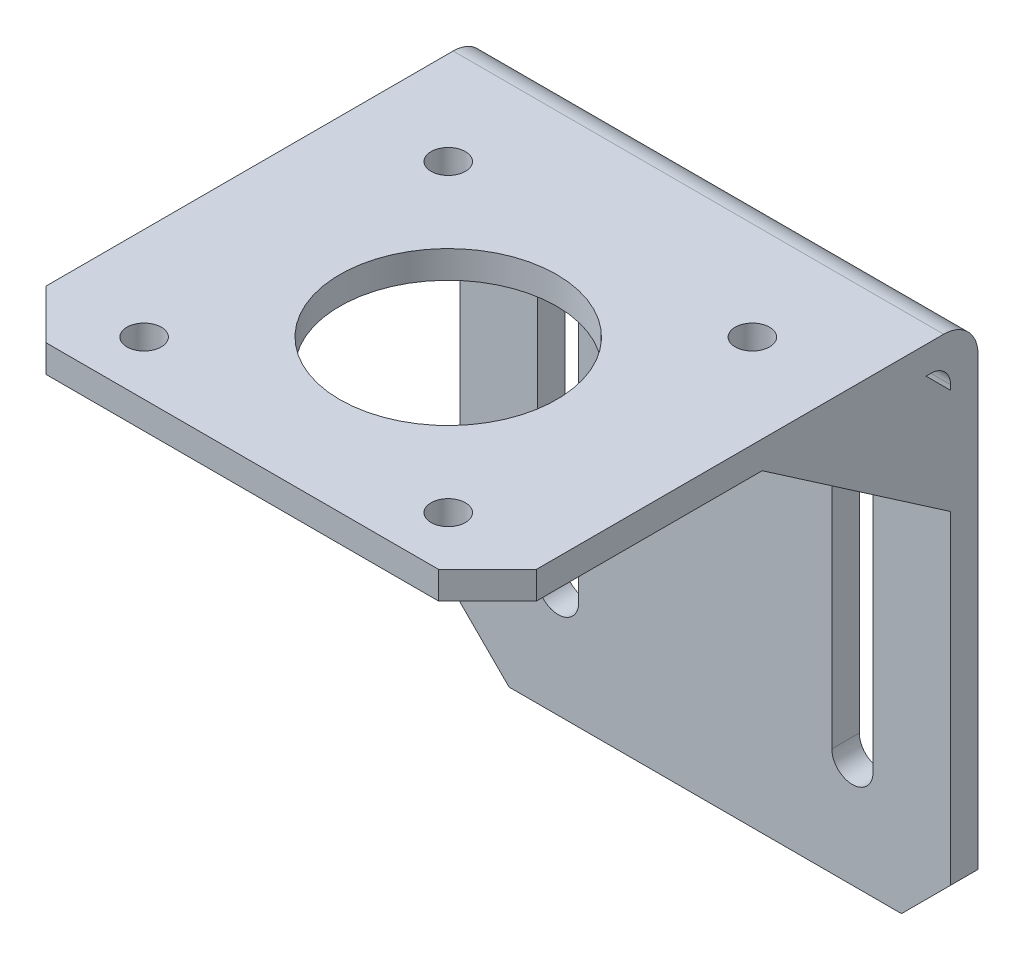
ISO-10303-21;
HEADER;
FILE_DESCRIPTION(('STEP AP214'),'2;1');
FILE_NAME('part.step','',(''),(''),'','','');
FILE_SCHEMA(('AUTOMOTIVE_DESIGN { 1 0 10303 214 1 1 1 1 }'));
ENDSEC;
DATA;
#1=APPLICATION_CONTEXT('core data for automotive mechanical design processes');
#2=APPLICATION_PROTOCOL_DEFINITION('international standard','automotive_design',2000,#1);
#3=PRODUCT_CONTEXT('',#1,'mechanical');
#4=PRODUCT('Part','Part','',(#3));
#5=PRODUCT_RELATED_PRODUCT_CATEGORY('part','',(#4));
#6=PRODUCT_DEFINITION_FORMATION('','',#4);
#7=PRODUCT_DEFINITION_CONTEXT('part definition',#1,'design');
#8=PRODUCT_DEFINITION('design','',#6,#7);
#9=PRODUCT_DEFINITION_SHAPE('','',#8);
#10=(LENGTH_UNIT() NAMED_UNIT(*) SI_UNIT(.MILLI.,.METRE.));
#11=(NAMED_UNIT(*) PLANE_ANGLE_UNIT() SI_UNIT($,.RADIAN.));
#12=(NAMED_UNIT(*) SI_UNIT($,.STERADIAN.) SOLID_ANGLE_UNIT());
#13=UNCERTAINTY_MEASURE_WITH_UNIT(LENGTH_MEASURE(1.E-05),#10,'distance_accuracy_value','');
#14=(GEOMETRIC_REPRESENTATION_CONTEXT(3) GLOBAL_UNCERTAINTY_ASSIGNED_CONTEXT((#13)) GLOBAL_UNIT_ASSIGNED_CONTEXT((#10,
#11,#12)) REPRESENTATION_CONTEXT('',''));
#15=CARTESIAN_POINT('',(0.,0.,0.));
#16=DIRECTION('',(0.,0.,1.));
#17=DIRECTION('',(1.,0.,0.));
#18=AXIS2_PLACEMENT_3D('',#15,#16,#17);
#19=CARTESIAN_POINT('',(-25.,-2.80000000000001,2.8));
#20=DIRECTION('',(0.,0.,1.));
#21=DIRECTION('',(0.,-1.,0.));
#22=AXIS2_PLACEMENT_3D('',#19,#20,#21);
#23=PLANE('',#22);
#24=CARTESIAN_POINT('',(15.,-43.,2.8));
#25=DIRECTION('',(0.,0.,1.));
#26=DIRECTION('',(0.,-1.,0.));
#27=AXIS2_PLACEMENT_3D('',#24,#25,#26);
#28=CIRCLE('',#27,2.1);
#29=CARTESIAN_POINT('',(12.9,-43.,2.8));
#30=VERTEX_POINT('',#29);
#31=CARTESIAN_POINT('',(17.1,-43.,2.8));
#32=VERTEX_POINT('',#31);
#33=EDGE_CURVE('E472',#30,#32,#28,.T.);
#34=ORIENTED_EDGE('',*,*,#33,.F.);
#35=DIRECTION('',(0.,-1.,0.));
#36=VECTOR('',#35,1.);
#37=CARTESIAN_POINT('',(12.9,-2.80000000000001,2.8));
#38=LINE('',#37,#36);
#39=CARTESIAN_POINT('',(12.9,-13.,2.8));
#40=VERTEX_POINT('',#39);
#41=EDGE_CURVE('E462',#40,#30,#38,.T.);
#42=ORIENTED_EDGE('',*,*,#41,.F.);
#43=CARTESIAN_POINT('',(15.,-13.,2.8));
#44=DIRECTION('',(0.,0.,1.));
#45=DIRECTION('',(0.,-1.,0.));
#46=AXIS2_PLACEMENT_3D('',#43,#44,#45);
#47=CIRCLE('',#46,2.1);
#48=CARTESIAN_POINT('',(17.1,-13.,2.8));
#49=VERTEX_POINT('',#48);
#50=EDGE_CURVE('E465',#49,#40,#47,.T.);
#51=ORIENTED_EDGE('',*,*,#50,.F.);
#52=DIRECTION('',(0.,1.,0.));
#53=VECTOR('',#52,1.);
#54=CARTESIAN_POINT('',(17.1,-2.80000000000002,2.8));
#55=LINE('',#54,#53);
#56=EDGE_CURVE('E469',#32,#49,#55,.T.);
#57=ORIENTED_EDGE('',*,*,#56,.F.);
#58=EDGE_LOOP('',(#34,#42,#51,#57));
#59=FACE_BOUND('',#58,.T.);
#60=CARTESIAN_POINT('',(-15.,-43.,2.8));
#61=DIRECTION('',(0.,0.,1.));
#62=DIRECTION('',(0.,-1.,0.));
#63=AXIS2_PLACEMENT_3D('',#60,#61,#62);
#64=CIRCLE('',#63,2.1);
#65=CARTESIAN_POINT('',(-17.1,-43.,2.8));
#66=VERTEX_POINT('',#65);
#67=CARTESIAN_POINT('',(-12.9,-43.,2.8));
#68=VERTEX_POINT('',#67);
#69=EDGE_CURVE('E459',#66,#68,#64,.T.);
#70=ORIENTED_EDGE('',*,*,#69,.F.);
#71=DIRECTION('',(0.,-1.,0.));
#72=VECTOR('',#71,1.);
#73=CARTESIAN_POINT('',(-17.1,-2.80000000000001,2.8));
#74=LINE('',#73,#72);
#75=CARTESIAN_POINT('',(-17.1,-13.,2.8));
#76=VERTEX_POINT('',#75);
#77=EDGE_CURVE('E420',#76,#66,#74,.T.);
#78=ORIENTED_EDGE('',*,*,#77,.F.);
#79=CARTESIAN_POINT('',(-15.,-13.,2.8));
#80=DIRECTION('',(0.,0.,1.));
#81=DIRECTION('',(0.,-1.,0.));
#82=AXIS2_PLACEMENT_3D('',#79,#80,#81);
#83=CIRCLE('',#82,2.1);
#84=CARTESIAN_POINT('',(-12.9,-13.,2.8));
#85=VERTEX_POINT('',#84);
#86=EDGE_CURVE('E452',#85,#76,#83,.T.);
#87=ORIENTED_EDGE('',*,*,#86,.F.);
#88=DIRECTION('',(0.,1.,0.));
#89=VECTOR('',#88,1.);
#90=CARTESIAN_POINT('',(-12.9,-2.80000000000001,2.8));
#91=LINE('',#90,#89);
#92=EDGE_CURVE('E456',#68,#85,#91,.T.);
#93=ORIENTED_EDGE('',*,*,#92,.F.);
#94=EDGE_LOOP('',(#70,#78,#87,#93));
#95=FACE_BOUND('',#94,.T.);
#96=DIRECTION('',(0.,-1.,0.));
#97=VECTOR('',#96,1.);
#98=CARTESIAN_POINT('',(25.,-2.80000000000001,2.8));
#99=LINE('',#98,#97);
#100=CARTESIAN_POINT('',(25.,-16.,2.8));
#101=VERTEX_POINT('',#100);
#102=CARTESIAN_POINT('',(25.,-49.,2.79999999999999));
#103=VERTEX_POINT('',#102);
#104=EDGE_CURVE('E392',#101,#103,#99,.T.);
#105=ORIENTED_EDGE('',*,*,#104,.F.);
#106=DIRECTION('',(1.,0.,0.));
#107=VECTOR('',#106,1.);
#108=CARTESIAN_POINT('',(22.5,-16.,2.8));
#109=LINE('',#108,#107);
#110=CARTESIAN_POINT('',(22.5,-16.,2.8));
#111=VERTEX_POINT('',#110);
#112=EDGE_CURVE('E55',#111,#101,#109,.T.);
#113=ORIENTED_EDGE('',*,*,#112,.F.);
#114=DIRECTION('',(0.,-1.,0.));
#115=VECTOR('',#114,1.);
#116=CARTESIAN_POINT('',(22.5,-16.,2.8));
#117=LINE('',#116,#115);
#118=CARTESIAN_POINT('',(22.5,-5.30000000000003,2.8));
#119=VERTEX_POINT('',#118);
#120=EDGE_CURVE('E229',#119,#111,#117,.T.);
#121=ORIENTED_EDGE('',*,*,#120,.F.);
#122=DIRECTION('',(1.,0.,0.));
#123=VECTOR('',#122,1.);
#124=CARTESIAN_POINT('',(22.5,-5.30000000000003,2.8));
#125=LINE('',#124,#123);
#126=CARTESIAN_POINT('',(25.,-5.30000000000003,2.8));
#127=VERTEX_POINT('',#126);
#128=EDGE_CURVE('E237',#119,#127,#125,.T.);
#129=ORIENTED_EDGE('',*,*,#128,.T.);
#130=CARTESIAN_POINT('',(25.,-4.80000000000001,2.8));
#131=VERTEX_POINT('',#130);
#132=EDGE_CURVE('E393',#131,#127,#99,.T.);
#133=ORIENTED_EDGE('',*,*,#132,.F.);
#134=DIRECTION('',(1.,0.,0.));
#135=VECTOR('',#134,1.);
#136=CARTESIAN_POINT('',(-25.,-4.80000000000001,2.8));
#137=LINE('',#136,#135);
#138=CARTESIAN_POINT('',(-25.,-4.80000000000001,2.8));
#139=VERTEX_POINT('',#138);
#140=EDGE_CURVE('E535',#131,#139,#137,.F.);
#141=ORIENTED_EDGE('',*,*,#140,.T.);
#142=DIRECTION('',(0.,-1.,0.));
#143=VECTOR('',#142,1.);
#144=CARTESIAN_POINT('',(-25.,-2.80000000000001,2.8));
#145=LINE('',#144,#143);
#146=CARTESIAN_POINT('',(-25.,-5.30000000000003,2.8));
#147=VERTEX_POINT('',#146);
#148=EDGE_CURVE('E408',#139,#147,#145,.T.);
#149=ORIENTED_EDGE('',*,*,#148,.T.);
#150=DIRECTION('',(-1.,0.,0.));
#151=VECTOR('',#150,1.);
#152=CARTESIAN_POINT('',(-22.5,-5.30000000000003,2.8));
#153=LINE('',#152,#151);
#154=CARTESIAN_POINT('',(-22.5,-5.30000000000003,2.8));
#155=VERTEX_POINT('',#154);
#156=EDGE_CURVE('E291',#155,#147,#153,.T.);
#157=ORIENTED_EDGE('',*,*,#156,.F.);
#158=DIRECTION('',(0.,-1.,0.));
#159=VECTOR('',#158,1.);
#160=CARTESIAN_POINT('',(-22.5,-16.,2.8));
#161=LINE('',#160,#159);
#162=CARTESIAN_POINT('',(-22.5,-16.,2.8));
#163=VERTEX_POINT('',#162);
#164=EDGE_CURVE('E269',#155,#163,#161,.T.);
#165=ORIENTED_EDGE('',*,*,#164,.T.);
#166=DIRECTION('',(-1.,0.,0.));
#167=VECTOR('',#166,1.);
#168=CARTESIAN_POINT('',(-22.5,-16.,2.8));
#169=LINE('',#168,#167);
#170=CARTESIAN_POINT('',(-25.,-16.,2.8));
#171=VERTEX_POINT('',#170);
#172=EDGE_CURVE('E284',#163,#171,#169,.T.);
#173=ORIENTED_EDGE('',*,*,#172,.T.);
#174=CARTESIAN_POINT('',(-25.,-49.,2.79999999999999));
#175=VERTEX_POINT('',#174);
#176=EDGE_CURVE('E407',#171,#175,#145,.T.);
#177=ORIENTED_EDGE('',*,*,#176,.T.);
#178=DIRECTION('',(0.707106781186546,-0.707106781186548,0.));
#179=VECTOR('',#178,1.);
#180=CARTESIAN_POINT('',(-48.1,-25.8999999999999,2.8));
#181=LINE('',#180,#179);
#182=CARTESIAN_POINT('',(-20.,-54.,2.79999999999999));
#183=VERTEX_POINT('',#182);
#184=EDGE_CURVE('E496',#175,#183,#181,.T.);
#185=ORIENTED_EDGE('',*,*,#184,.T.);
#186=DIRECTION('',(1.,0.,0.));
#187=VECTOR('',#186,1.);
#188=CARTESIAN_POINT('',(-25.,-54.,2.79999999999999));
#189=LINE('',#188,#187);
#190=CARTESIAN_POINT('',(20.,-54.,2.79999999999999));
#191=VERTEX_POINT('',#190);
#192=EDGE_CURVE('E421',#183,#191,#189,.T.);
#193=ORIENTED_EDGE('',*,*,#192,.T.);
#194=DIRECTION('',(-0.707106781186549,-0.707106781186547,0.));
#195=VECTOR('',#194,1.);
#196=CARTESIAN_POINT('',(23.0999999999999,-50.9000000000001,2.79999999999999));
#197=LINE('',#196,#195);
#198=EDGE_CURVE('E499',#191,#103,#197,.F.);
#199=ORIENTED_EDGE('',*,*,#198,.T.);
#200=EDGE_LOOP('',(#105,#113,#121,#129,#133,#141,#149,#157,#165,#173,#177,#185,#193,#199));
#201=FACE_BOUND('',#200,.T.);
#202=ADVANCED_FACE('F39',(#59,#95,#201),#23,.T.);
#203=CARTESIAN_POINT('',(-25.,-2.80000000000001,50.));
#204=DIRECTION('',(0.,-1.,0.));
#205=DIRECTION('',(0.,0.,-1.));
#206=AXIS2_PLACEMENT_3D('',#203,#204,#205);
#207=PLANE('',#206);
#208=CARTESIAN_POINT('',(-15.5,-2.8,44.5));
#209=DIRECTION('',(0.,-1.,0.));
#210=DIRECTION('',(0.,0.,-1.));
#211=AXIS2_PLACEMENT_3D('',#208,#209,#210);
#212=CIRCLE('',#211,1.75);
#213=CARTESIAN_POINT('',(-15.5,-2.8,42.75));
#214=VERTEX_POINT('',#213);
#215=EDGE_CURVE('E387',#214,#214,#212,.T.);
#216=ORIENTED_EDGE('',*,*,#215,.F.);
#217=EDGE_LOOP('',(#216));
#218=FACE_BOUND('',#217,.T.);
#219=CARTESIAN_POINT('',(15.5,-2.8,44.5));
#220=DIRECTION('',(0.,-1.,0.));
#221=DIRECTION('',(0.,0.,-1.));
#222=AXIS2_PLACEMENT_3D('',#219,#220,#221);
#223=CIRCLE('',#222,1.75);
#224=CARTESIAN_POINT('',(15.5,-2.8,42.75));
#225=VERTEX_POINT('',#224);
#226=EDGE_CURVE('E443',#225,#225,#223,.T.);
#227=ORIENTED_EDGE('',*,*,#226,.F.);
#228=EDGE_LOOP('',(#227));
#229=FACE_BOUND('',#228,.T.);
#230=CARTESIAN_POINT('',(15.5,-2.8,13.5));
#231=DIRECTION('',(0.,-1.,0.));
#232=DIRECTION('',(0.,0.,-1.));
#233=AXIS2_PLACEMENT_3D('',#230,#231,#232);
#234=CIRCLE('',#233,1.75);
#235=CARTESIAN_POINT('',(15.5,-2.8,11.75));
#236=VERTEX_POINT('',#235);
#237=EDGE_CURVE('E439',#236,#236,#234,.T.);
#238=ORIENTED_EDGE('',*,*,#237,.F.);
#239=EDGE_LOOP('',(#238));
#240=FACE_BOUND('',#239,.T.);
#241=CARTESIAN_POINT('',(-15.5,-2.8,13.5));
#242=DIRECTION('',(0.,-1.,0.));
#243=DIRECTION('',(0.,0.,-1.));
#244=AXIS2_PLACEMENT_3D('',#241,#242,#243);
#245=CIRCLE('',#244,1.75);
#246=CARTESIAN_POINT('',(-15.5,-2.8,11.75));
#247=VERTEX_POINT('',#246);
#248=EDGE_CURVE('E435',#247,#247,#245,.T.);
#249=ORIENTED_EDGE('',*,*,#248,.F.);
#250=EDGE_LOOP('',(#249));
#251=FACE_BOUND('',#250,.T.);
#252=CARTESIAN_POINT('',(0.,-2.8,29.));
#253=DIRECTION('',(0.,-1.,0.));
#254=DIRECTION('',(0.,0.,-1.));
#255=AXIS2_PLACEMENT_3D('',#252,#253,#254);
#256=CIRCLE('',#255,11.05);
#257=CARTESIAN_POINT('',(0.,-2.8,17.95));
#258=VERTEX_POINT('',#257);
#259=EDGE_CURVE('E382',#258,#258,#256,.T.);
#260=ORIENTED_EDGE('',*,*,#259,.F.);
#261=EDGE_LOOP('',(#260));
#262=FACE_BOUND('',#261,.T.);
#263=DIRECTION('',(0.,0.,-1.));
#264=VECTOR('',#263,1.);
#265=CARTESIAN_POINT('',(22.5,-2.80000000000001,5.3));
#266=LINE('',#265,#264);
#267=CARTESIAN_POINT('',(22.5,-2.8,22.));
#268=VERTEX_POINT('',#267);
#269=CARTESIAN_POINT('',(22.5,-2.80000000000001,5.3));
#270=VERTEX_POINT('',#269);
#271=EDGE_CURVE('E231',#268,#270,#266,.T.);
#272=ORIENTED_EDGE('',*,*,#271,.F.);
#273=DIRECTION('',(1.,0.,0.));
#274=VECTOR('',#273,1.);
#275=CARTESIAN_POINT('',(22.5,-2.8,22.));
#276=LINE('',#275,#274);
#277=CARTESIAN_POINT('',(25.,-2.8,22.));
#278=VERTEX_POINT('',#277);
#279=EDGE_CURVE('E263',#268,#278,#276,.T.);
#280=ORIENTED_EDGE('',*,*,#279,.T.);
#281=DIRECTION('',(0.,0.,-1.));
#282=VECTOR('',#281,1.);
#283=CARTESIAN_POINT('',(25.,-2.80000000000001,50.));
#284=LINE('',#283,#282);
#285=CARTESIAN_POINT('',(25.,-2.80000000000001,45.));
#286=VERTEX_POINT('',#285);
#287=EDGE_CURVE('E388',#286,#278,#284,.T.);
#288=ORIENTED_EDGE('',*,*,#287,.F.);
#289=DIRECTION('',(0.707106781186549,0.,-0.707106781186547));
#290=VECTOR('',#289,1.);
#291=CARTESIAN_POINT('',(-2.50000000000008,-2.80000000000001,72.5));
#292=LINE('',#291,#290);
#293=CARTESIAN_POINT('',(20.,-2.80000000000001,50.));
#294=VERTEX_POINT('',#293);
#295=EDGE_CURVE('E518',#286,#294,#292,.F.);
#296=ORIENTED_EDGE('',*,*,#295,.T.);
#297=DIRECTION('',(1.,0.,0.));
#298=VECTOR('',#297,1.);
#299=CARTESIAN_POINT('',(-25.,-2.80000000000001,50.));
#300=LINE('',#299,#298);
#301=CARTESIAN_POINT('',(-20.,-2.80000000000001,50.));
#302=VERTEX_POINT('',#301);
#303=EDGE_CURVE('E425',#302,#294,#300,.T.);
#304=ORIENTED_EDGE('',*,*,#303,.F.);
#305=DIRECTION('',(-0.707106781186547,0.,-0.707106781186549));
#306=VECTOR('',#305,1.);
#307=CARTESIAN_POINT('',(-22.5,-2.80000000000001,47.5));
#308=LINE('',#307,#306);
#309=CARTESIAN_POINT('',(-25.,-2.80000000000001,45.));
#310=VERTEX_POINT('',#309);
#311=EDGE_CURVE('E521',#302,#310,#308,.T.);
#312=ORIENTED_EDGE('',*,*,#311,.T.);
#313=DIRECTION('',(0.,0.,-1.));
#314=VECTOR('',#313,1.);
#315=CARTESIAN_POINT('',(-25.,-2.80000000000001,50.));
#316=LINE('',#315,#314);
#317=CARTESIAN_POINT('',(-25.,-2.8,22.));
#318=VERTEX_POINT('',#317);
#319=EDGE_CURVE('E404',#310,#318,#316,.T.);
#320=ORIENTED_EDGE('',*,*,#319,.T.);
#321=DIRECTION('',(-1.,0.,0.));
#322=VECTOR('',#321,1.);
#323=CARTESIAN_POINT('',(-22.5,-2.8,22.));
#324=LINE('',#323,#322);
#325=CARTESIAN_POINT('',(-22.5,-2.80000000000001,22.));
#326=VERTEX_POINT('',#325);
#327=EDGE_CURVE('E300',#326,#318,#324,.T.);
#328=ORIENTED_EDGE('',*,*,#327,.F.);
#329=DIRECTION('',(0.,0.,-1.));
#330=VECTOR('',#329,1.);
#331=CARTESIAN_POINT('',(-22.5,-2.80000000000001,5.3));
#332=LINE('',#331,#330);
#333=CARTESIAN_POINT('',(-22.5,-2.80000000000001,5.3));
#334=VERTEX_POINT('',#333);
#335=EDGE_CURVE('E277',#326,#334,#332,.T.);
#336=ORIENTED_EDGE('',*,*,#335,.T.);
#337=DIRECTION('',(-1.,0.,0.));
#338=VECTOR('',#337,1.);
#339=CARTESIAN_POINT('',(-22.5,-2.80000000000001,5.3));
#340=LINE('',#339,#338);
#341=CARTESIAN_POINT('',(-25.,-2.80000000000001,5.3));
#342=VERTEX_POINT('',#341);
#343=EDGE_CURVE('E296',#334,#342,#340,.T.);
#344=ORIENTED_EDGE('',*,*,#343,.T.);
#345=CARTESIAN_POINT('',(-25.,-2.80000000000001,4.8));
#346=VERTEX_POINT('',#345);
#347=EDGE_CURVE('E403',#342,#346,#316,.T.);
#348=ORIENTED_EDGE('',*,*,#347,.T.);
#349=DIRECTION('',(1.,0.,0.));
#350=VECTOR('',#349,1.);
#351=CARTESIAN_POINT('',(25.,-2.80000000000001,4.8));
#352=LINE('',#351,#350);
#353=CARTESIAN_POINT('',(25.,-2.80000000000001,4.8));
#354=VERTEX_POINT('',#353);
#355=EDGE_CURVE('E531',#346,#354,#352,.T.);
#356=ORIENTED_EDGE('',*,*,#355,.T.);
#357=CARTESIAN_POINT('',(25.,-2.80000000000001,5.3));
#358=VERTEX_POINT('',#357);
#359=EDGE_CURVE('E386',#358,#354,#284,.T.);
#360=ORIENTED_EDGE('',*,*,#359,.F.);
#361=DIRECTION('',(1.,0.,0.));
#362=VECTOR('',#361,1.);
#363=CARTESIAN_POINT('',(22.5,-2.80000000000001,5.3));
#364=LINE('',#363,#362);
#365=EDGE_CURVE('E242',#270,#358,#364,.T.);
#366=ORIENTED_EDGE('',*,*,#365,.F.);
#367=EDGE_LOOP('',(#272,#280,#288,#296,#304,#312,#320,#328,#336,#344,#348,#356,#360,#366));
#368=FACE_BOUND('',#367,.T.);
#369=ADVANCED_FACE('F582',(#218,#229,#240,#251,#262,#368),#207,.T.);
#370=CARTESIAN_POINT('',(-25.,0.,0.));
#371=DIRECTION('',(0.,1.,0.));
#372=DIRECTION('',(0.,0.,1.));
#373=AXIS2_PLACEMENT_3D('',#370,#371,#372);
#374=PLANE('',#373);
#375=CARTESIAN_POINT('',(-15.5,0.,44.5));
#376=DIRECTION('',(0.,1.,0.));
#377=DIRECTION('',(0.,0.,1.));
#378=AXIS2_PLACEMENT_3D('',#375,#376,#377);
#379=CIRCLE('',#378,1.75);
#380=CARTESIAN_POINT('',(-15.5,0.,46.25));
#381=VERTEX_POINT('',#380);
#382=EDGE_CURVE('E327',#381,#381,#379,.T.);
#383=ORIENTED_EDGE('',*,*,#382,.F.);
#384=EDGE_LOOP('',(#383));
#385=FACE_BOUND('',#384,.T.);
#386=CARTESIAN_POINT('',(15.5,0.,44.5));
#387=DIRECTION('',(0.,1.,0.));
#388=DIRECTION('',(0.,0.,1.));
#389=AXIS2_PLACEMENT_3D('',#386,#387,#388);
#390=CIRCLE('',#389,1.75);
#391=CARTESIAN_POINT('',(15.5,0.,46.25));
#392=VERTEX_POINT('',#391);
#393=EDGE_CURVE('E372',#392,#392,#390,.T.);
#394=ORIENTED_EDGE('',*,*,#393,.F.);
#395=EDGE_LOOP('',(#394));
#396=FACE_BOUND('',#395,.T.);
#397=CARTESIAN_POINT('',(15.5,0.,13.5));
#398=DIRECTION('',(0.,1.,0.));
#399=DIRECTION('',(0.,0.,1.));
#400=AXIS2_PLACEMENT_3D('',#397,#398,#399);
#401=CIRCLE('',#400,1.75);
#402=CARTESIAN_POINT('',(15.5,0.,15.25));
#403=VERTEX_POINT('',#402);
#404=EDGE_CURVE('E368',#403,#403,#401,.T.);
#405=ORIENTED_EDGE('',*,*,#404,.F.);
#406=EDGE_LOOP('',(#405));
#407=FACE_BOUND('',#406,.T.);
#408=CARTESIAN_POINT('',(-15.5,0.,13.5));
#409=DIRECTION('',(0.,1.,0.));
#410=DIRECTION('',(0.,0.,1.));
#411=AXIS2_PLACEMENT_3D('',#408,#409,#410);
#412=CIRCLE('',#411,1.75);
#413=CARTESIAN_POINT('',(-15.5,0.,15.25));
#414=VERTEX_POINT('',#413);
#415=EDGE_CURVE('E363',#414,#414,#412,.T.);
#416=ORIENTED_EDGE('',*,*,#415,.F.);
#417=EDGE_LOOP('',(#416));
#418=FACE_BOUND('',#417,.T.);
#419=CARTESIAN_POINT('',(0.,0.,29.));
#420=DIRECTION('',(0.,1.,0.));
#421=DIRECTION('',(0.,0.,1.));
#422=AXIS2_PLACEMENT_3D('',#419,#420,#421);
#423=CIRCLE('',#422,11.05);
#424=CARTESIAN_POINT('',(0.,0.,40.05));
#425=VERTEX_POINT('',#424);
#426=EDGE_CURVE('E367',#425,#425,#423,.T.);
#427=ORIENTED_EDGE('',*,*,#426,.F.);
#428=EDGE_LOOP('',(#427));
#429=FACE_BOUND('',#428,.T.);
#430=DIRECTION('',(0.,0.,1.));
#431=VECTOR('',#430,1.);
#432=CARTESIAN_POINT('',(25.,0.,0.));
#433=LINE('',#432,#431);
#434=CARTESIAN_POINT('',(25.,0.,3.5));
#435=VERTEX_POINT('',#434);
#436=CARTESIAN_POINT('',(25.,0.,45.));
#437=VERTEX_POINT('',#436);
#438=EDGE_CURVE('E383',#435,#437,#433,.T.);
#439=ORIENTED_EDGE('',*,*,#438,.F.);
#440=DIRECTION('',(1.,0.,0.));
#441=VECTOR('',#440,1.);
#442=CARTESIAN_POINT('',(-25.,0.,3.5));
#443=LINE('',#442,#441);
#444=CARTESIAN_POINT('',(-25.,0.,3.5));
#445=VERTEX_POINT('',#444);
#446=EDGE_CURVE('E552',#435,#445,#443,.F.);
#447=ORIENTED_EDGE('',*,*,#446,.T.);
#448=DIRECTION('',(0.,0.,1.));
#449=VECTOR('',#448,1.);
#450=CARTESIAN_POINT('',(-25.,0.,0.));
#451=LINE('',#450,#449);
#452=CARTESIAN_POINT('',(-25.,0.,45.));
#453=VERTEX_POINT('',#452);
#454=EDGE_CURVE('E400',#445,#453,#451,.T.);
#455=ORIENTED_EDGE('',*,*,#454,.T.);
#456=DIRECTION('',(0.707106781186547,0.,0.707106781186549));
#457=VECTOR('',#456,1.);
#458=CARTESIAN_POINT('',(-47.5,0.,22.4999999999999));
#459=LINE('',#458,#457);
#460=CARTESIAN_POINT('',(-20.,0.,50.));
#461=VERTEX_POINT('',#460);
#462=EDGE_CURVE('E528',#453,#461,#459,.T.);
#463=ORIENTED_EDGE('',*,*,#462,.T.);
#464=DIRECTION('',(1.,0.,0.));
#465=VECTOR('',#464,1.);
#466=CARTESIAN_POINT('',(-25.,0.,50.));
#467=LINE('',#466,#465);
#468=CARTESIAN_POINT('',(20.,0.,50.));
#469=VERTEX_POINT('',#468);
#470=EDGE_CURVE('E415',#461,#469,#467,.T.);
#471=ORIENTED_EDGE('',*,*,#470,.T.);
#472=DIRECTION('',(-0.707106781186549,0.,0.707106781186547));
#473=VECTOR('',#472,1.);
#474=CARTESIAN_POINT('',(22.4999999999999,0.,47.5000000000001));
#475=LINE('',#474,#473);
#476=EDGE_CURVE('E524',#469,#437,#475,.F.);
#477=ORIENTED_EDGE('',*,*,#476,.T.);
#478=EDGE_LOOP('',(#439,#447,#455,#463,#471,#477));
#479=FACE_BOUND('',#478,.T.);
#480=ADVANCED_FACE('F573',(#385,#396,#407,#418,#429,#479),#374,.T.);
#481=CARTESIAN_POINT('',(-25.,-54.,0.));
#482=DIRECTION('',(0.,0.,-1.));
#483=DIRECTION('',(-1.,0.,0.));
#484=AXIS2_PLACEMENT_3D('',#481,#482,#483);
#485=PLANE('',#484);
#486=CARTESIAN_POINT('',(0.,-29.,0.));
#487=DIRECTION('',(0.,0.,-1.));
#488=DIRECTION('',(-1.,0.,0.));
#489=AXIS2_PLACEMENT_3D('',#486,#487,#488);
#490=CIRCLE('',#489,3.175);
#491=CARTESIAN_POINT('',(-3.175,-29.,0.));
#492=VERTEX_POINT('',#491);
#493=EDGE_CURVE('E11',#492,#492,#490,.T.);
#494=ORIENTED_EDGE('',*,*,#493,.F.);
#495=EDGE_LOOP('',(#494));
#496=FACE_BOUND('',#495,.T.);
#497=CARTESIAN_POINT('',(15.,-43.,0.));
#498=DIRECTION('',(0.,0.,-1.));
#499=DIRECTION('',(-1.,0.,0.));
#500=AXIS2_PLACEMENT_3D('',#497,#498,#499);
#501=CIRCLE('',#500,2.1);
#502=CARTESIAN_POINT('',(17.1,-43.,0.));
#503=VERTEX_POINT('',#502);
#504=CARTESIAN_POINT('',(12.9,-43.,0.));
#505=VERTEX_POINT('',#504);
#506=EDGE_CURVE('E307',#503,#505,#501,.T.);
#507=ORIENTED_EDGE('',*,*,#506,.F.);
#508=DIRECTION('',(0.,-1.,0.));
#509=VECTOR('',#508,1.);
#510=CARTESIAN_POINT('',(17.1,-43.,0.));
#511=LINE('',#510,#509);
#512=CARTESIAN_POINT('',(17.1,-13.,0.));
#513=VERTEX_POINT('',#512);
#514=EDGE_CURVE('E319',#513,#503,#511,.T.);
#515=ORIENTED_EDGE('',*,*,#514,.F.);
#516=CARTESIAN_POINT('',(15.,-13.,0.));
#517=DIRECTION('',(0.,0.,-1.));
#518=DIRECTION('',(-1.,0.,0.));
#519=AXIS2_PLACEMENT_3D('',#516,#517,#518);
#520=CIRCLE('',#519,2.1);
#521=CARTESIAN_POINT('',(12.9,-13.,0.));
#522=VERTEX_POINT('',#521);
#523=EDGE_CURVE('E315',#522,#513,#520,.T.);
#524=ORIENTED_EDGE('',*,*,#523,.F.);
#525=DIRECTION('',(0.,1.,0.));
#526=VECTOR('',#525,1.);
#527=CARTESIAN_POINT('',(12.9,-43.,0.));
#528=LINE('',#527,#526);
#529=EDGE_CURVE('E310',#505,#522,#528,.T.);
#530=ORIENTED_EDGE('',*,*,#529,.F.);
#531=EDGE_LOOP('',(#507,#515,#524,#530));
#532=FACE_BOUND('',#531,.T.);
#533=CARTESIAN_POINT('',(-15.,-43.,0.));
#534=DIRECTION('',(0.,0.,-1.));
#535=DIRECTION('',(-1.,0.,0.));
#536=AXIS2_PLACEMENT_3D('',#533,#534,#535);
#537=CIRCLE('',#536,2.1);
#538=CARTESIAN_POINT('',(-12.9,-43.,0.));
#539=VERTEX_POINT('',#538);
#540=CARTESIAN_POINT('',(-17.1,-43.,0.));
#541=VERTEX_POINT('',#540);
#542=EDGE_CURVE('E295',#539,#541,#537,.T.);
#543=ORIENTED_EDGE('',*,*,#542,.F.);
#544=DIRECTION('',(0.,-1.,0.));
#545=VECTOR('',#544,1.);
#546=CARTESIAN_POINT('',(-12.9,-43.,0.));
#547=LINE('',#546,#545);
#548=CARTESIAN_POINT('',(-12.9,-13.,0.));
#549=VERTEX_POINT('',#548);
#550=EDGE_CURVE('E347',#549,#539,#547,.T.);
#551=ORIENTED_EDGE('',*,*,#550,.F.);
#552=CARTESIAN_POINT('',(-15.,-13.,0.));
#553=DIRECTION('',(0.,0.,-1.));
#554=DIRECTION('',(-1.,0.,0.));
#555=AXIS2_PLACEMENT_3D('',#552,#553,#554);
#556=CIRCLE('',#555,2.1);
#557=CARTESIAN_POINT('',(-17.1,-13.,0.));
#558=VERTEX_POINT('',#557);
#559=EDGE_CURVE('E343',#558,#549,#556,.T.);
#560=ORIENTED_EDGE('',*,*,#559,.F.);
#561=DIRECTION('',(0.,1.,0.));
#562=VECTOR('',#561,1.);
#563=CARTESIAN_POINT('',(-17.1,-43.,0.));
#564=LINE('',#563,#562);
#565=EDGE_CURVE('E339',#541,#558,#564,.T.);
#566=ORIENTED_EDGE('',*,*,#565,.F.);
#567=EDGE_LOOP('',(#543,#551,#560,#566));
#568=FACE_BOUND('',#567,.T.);
#569=DIRECTION('',(0.,1.,0.));
#570=VECTOR('',#569,1.);
#571=CARTESIAN_POINT('',(-25.,-54.,0.));
#572=LINE('',#571,#570);
#573=CARTESIAN_POINT('',(-25.,-49.,0.));
#574=VERTEX_POINT('',#573);
#575=CARTESIAN_POINT('',(-25.,-3.5,0.));
#576=VERTEX_POINT('',#575);
#577=EDGE_CURVE('E411',#574,#576,#572,.T.);
#578=ORIENTED_EDGE('',*,*,#577,.T.);
#579=DIRECTION('',(1.,0.,0.));
#580=VECTOR('',#579,1.);
#581=CARTESIAN_POINT('',(-25.,-3.5,0.));
#582=LINE('',#581,#580);
#583=CARTESIAN_POINT('',(25.,-3.5,0.));
#584=VERTEX_POINT('',#583);
#585=EDGE_CURVE('E545',#576,#584,#582,.T.);
#586=ORIENTED_EDGE('',*,*,#585,.T.);
#587=DIRECTION('',(0.,1.,0.));
#588=VECTOR('',#587,1.);
#589=CARTESIAN_POINT('',(25.,-54.,0.));
#590=LINE('',#589,#588);
#591=CARTESIAN_POINT('',(25.,-49.,0.));
#592=VERTEX_POINT('',#591);
#593=EDGE_CURVE('E396',#592,#584,#590,.T.);
#594=ORIENTED_EDGE('',*,*,#593,.F.);
#595=DIRECTION('',(0.707106781186549,0.707106781186547,0.));
#596=VECTOR('',#595,1.);
#597=CARTESIAN_POINT('',(-2.50000000000007,-76.5,0.));
#598=LINE('',#597,#596);
#599=CARTESIAN_POINT('',(20.,-54.,0.));
#600=VERTEX_POINT('',#599);
#601=EDGE_CURVE('E486',#592,#600,#598,.F.);
#602=ORIENTED_EDGE('',*,*,#601,.T.);
#603=DIRECTION('',(1.,0.,0.));
#604=VECTOR('',#603,1.);
#605=CARTESIAN_POINT('',(-25.,-54.,0.));
#606=LINE('',#605,#604);
#607=CARTESIAN_POINT('',(-20.,-54.,0.));
#608=VERTEX_POINT('',#607);
#609=EDGE_CURVE('E416',#608,#600,#606,.T.);
#610=ORIENTED_EDGE('',*,*,#609,.F.);
#611=DIRECTION('',(-0.707106781186547,0.707106781186549,0.));
#612=VECTOR('',#611,1.);
#613=CARTESIAN_POINT('',(-22.5,-51.5,0.));
#614=LINE('',#613,#612);
#615=EDGE_CURVE('E483',#608,#574,#614,.T.);
#616=ORIENTED_EDGE('',*,*,#615,.T.);
#617=EDGE_LOOP('',(#578,#586,#594,#602,#610,#616));
#618=FACE_BOUND('',#617,.T.);
#619=ADVANCED_FACE('F566',(#496,#532,#568,#618),#485,.T.);
#620=CARTESIAN_POINT('',(-25.,-54.,2.79999999999999));
#621=DIRECTION('',(0.,-1.,0.));
#622=DIRECTION('',(0.,0.,-1.));
#623=AXIS2_PLACEMENT_3D('',#620,#621,#622);
#624=PLANE('',#623);
#625=ORIENTED_EDGE('',*,*,#609,.T.);
#626=DIRECTION('',(0.,0.,1.));
#627=VECTOR('',#626,1.);
#628=CARTESIAN_POINT('',(20.,-54.,2.79999999999999));
#629=LINE('',#628,#627);
#630=EDGE_CURVE('E493',#600,#191,#629,.T.);
#631=ORIENTED_EDGE('',*,*,#630,.T.);
#632=ORIENTED_EDGE('',*,*,#192,.F.);
#633=DIRECTION('',(0.,0.,-1.));
#634=VECTOR('',#633,1.);
#635=CARTESIAN_POINT('',(-20.,-54.,0.));
#636=LINE('',#635,#634);
#637=EDGE_CURVE('E489',#183,#608,#636,.T.);
#638=ORIENTED_EDGE('',*,*,#637,.T.);
#639=EDGE_LOOP('',(#625,#631,#632,#638));
#640=FACE_BOUND('',#639,.T.);
#641=ADVANCED_FACE('F621',(#640),#624,.T.);
#642=CARTESIAN_POINT('',(-25.,0.,50.));
#643=DIRECTION('',(0.,0.,1.));
#644=DIRECTION('',(1.,0.,0.));
#645=AXIS2_PLACEMENT_3D('',#642,#643,#644);
#646=PLANE('',#645);
#647=ORIENTED_EDGE('',*,*,#470,.F.);
#648=DIRECTION('',(0.,-1.,0.));
#649=VECTOR('',#648,1.);
#650=CARTESIAN_POINT('',(-20.,-2.80000000000001,50.));
#651=LINE('',#650,#649);
#652=EDGE_CURVE('E514',#461,#302,#651,.T.);
#653=ORIENTED_EDGE('',*,*,#652,.T.);
#654=ORIENTED_EDGE('',*,*,#303,.T.);
#655=DIRECTION('',(0.,1.,0.));
#656=VECTOR('',#655,1.);
#657=CARTESIAN_POINT('',(20.,0.,50.));
#658=LINE('',#657,#656);
#659=EDGE_CURVE('E511',#294,#469,#658,.T.);
#660=ORIENTED_EDGE('',*,*,#659,.T.);
#661=EDGE_LOOP('',(#647,#653,#654,#660));
#662=FACE_BOUND('',#661,.T.);
#663=ADVANCED_FACE('F652',(#662),#646,.T.);
#664=CARTESIAN_POINT('',(-25.,0.,0.));
#665=DIRECTION('',(1.,0.,0.));
#666=DIRECTION('',(0.,0.,-1.));
#667=AXIS2_PLACEMENT_3D('',#664,#665,#666);
#668=PLANE('',#667);
#669=ORIENTED_EDGE('',*,*,#176,.F.);
#670=DIRECTION('',(0.,0.566528822887065,0.824041924199368));
#671=VECTOR('',#670,1.);
#672=CARTESIAN_POINT('',(-25.,-2.8,22.));
#673=LINE('',#672,#671);
#674=EDGE_CURVE('E262',#171,#318,#673,.T.);
#675=ORIENTED_EDGE('',*,*,#674,.T.);
#676=ORIENTED_EDGE('',*,*,#319,.F.);
#677=DIRECTION('',(0.,1.,0.));
#678=VECTOR('',#677,1.);
#679=CARTESIAN_POINT('',(-25.,0.,45.));
#680=LINE('',#679,#678);
#681=EDGE_CURVE('E503',#310,#453,#680,.T.);
#682=ORIENTED_EDGE('',*,*,#681,.T.);
#683=ORIENTED_EDGE('',*,*,#454,.F.);
#684=CARTESIAN_POINT('',(-25.,-3.5,3.5));
#685=DIRECTION('',(1.,0.,0.));
#686=DIRECTION('',(0.,0.,-1.));
#687=AXIS2_PLACEMENT_3D('',#684,#685,#686);
#688=CIRCLE('',#687,3.5);
#689=EDGE_CURVE('E48',#445,#576,#688,.F.);
#690=ORIENTED_EDGE('',*,*,#689,.T.);
#691=ORIENTED_EDGE('',*,*,#577,.F.);
#692=DIRECTION('',(0.,0.,1.));
#693=VECTOR('',#692,1.);
#694=CARTESIAN_POINT('',(-25.,-49.,2.79999999999999));
#695=LINE('',#694,#693);
#696=EDGE_CURVE('E507',#574,#175,#695,.T.);
#697=ORIENTED_EDGE('',*,*,#696,.T.);
#698=EDGE_LOOP('',(#669,#675,#676,#682,#683,#690,#691,#697));
#699=FACE_BOUND('',#698,.T.);
#700=DIRECTION('',(0.,-0.707106781186551,-0.707106781186544));
#701=VECTOR('',#700,1.);
#702=CARTESIAN_POINT('',(-25.,-5.30000000000003,2.8));
#703=LINE('',#702,#701);
#704=EDGE_CURVE('E273',#342,#147,#703,.T.);
#705=ORIENTED_EDGE('',*,*,#704,.T.);
#706=ORIENTED_EDGE('',*,*,#148,.F.);
#707=CARTESIAN_POINT('',(-25.,-4.80000000000001,4.8));
#708=DIRECTION('',(1.,0.,0.));
#709=DIRECTION('',(0.,0.,-1.));
#710=AXIS2_PLACEMENT_3D('',#707,#708,#709);
#711=CIRCLE('',#710,2.);
#712=EDGE_CURVE('E541',#139,#346,#711,.T.);
#713=ORIENTED_EDGE('',*,*,#712,.T.);
#714=ORIENTED_EDGE('',*,*,#347,.F.);
#715=EDGE_LOOP('',(#705,#706,#713,#714));
#716=FACE_BOUND('',#715,.T.);
#717=ADVANCED_FACE('F559',(#699,#716),#668,.F.);
#718=CARTESIAN_POINT('',(25.,0.,0.));
#719=DIRECTION('',(1.,0.,0.));
#720=DIRECTION('',(0.,0.,-1.));
#721=AXIS2_PLACEMENT_3D('',#718,#719,#720);
#722=PLANE('',#721);
#723=DIRECTION('',(0.,0.566528822887065,0.824041924199368));
#724=VECTOR('',#723,1.);
#725=CARTESIAN_POINT('',(25.,-2.8,22.));
#726=LINE('',#725,#724);
#727=EDGE_CURVE('E247',#101,#278,#726,.T.);
#728=ORIENTED_EDGE('',*,*,#727,.F.);
#729=ORIENTED_EDGE('',*,*,#104,.T.);
#730=DIRECTION('',(0.,0.,-1.));
#731=VECTOR('',#730,1.);
#732=CARTESIAN_POINT('',(25.,-49.,0.));
#733=LINE('',#732,#731);
#734=EDGE_CURVE('E479',#103,#592,#733,.T.);
#735=ORIENTED_EDGE('',*,*,#734,.T.);
#736=ORIENTED_EDGE('',*,*,#593,.T.);
#737=CARTESIAN_POINT('',(25.,-3.5,3.5));
#738=DIRECTION('',(1.,0.,0.));
#739=DIRECTION('',(0.,0.,-1.));
#740=AXIS2_PLACEMENT_3D('',#737,#738,#739);
#741=CIRCLE('',#740,3.5);
#742=EDGE_CURVE('E549',#584,#435,#741,.T.);
#743=ORIENTED_EDGE('',*,*,#742,.T.);
#744=ORIENTED_EDGE('',*,*,#438,.T.);
#745=DIRECTION('',(0.,-1.,0.));
#746=VECTOR('',#745,1.);
#747=CARTESIAN_POINT('',(25.,0.,45.));
#748=LINE('',#747,#746);
#749=EDGE_CURVE('E475',#437,#286,#748,.T.);
#750=ORIENTED_EDGE('',*,*,#749,.T.);
#751=ORIENTED_EDGE('',*,*,#287,.T.);
#752=EDGE_LOOP('',(#728,#729,#735,#736,#743,#744,#750,#751));
#753=FACE_BOUND('',#752,.T.);
#754=ORIENTED_EDGE('',*,*,#132,.T.);
#755=DIRECTION('',(0.,-0.707106781186551,-0.707106781186544));
#756=VECTOR('',#755,1.);
#757=CARTESIAN_POINT('',(25.,-5.30000000000003,2.8));
#758=LINE('',#757,#756);
#759=EDGE_CURVE('E63',#358,#127,#758,.T.);
#760=ORIENTED_EDGE('',*,*,#759,.F.);
#761=ORIENTED_EDGE('',*,*,#359,.T.);
#762=CARTESIAN_POINT('',(25.,-4.80000000000001,4.8));
#763=DIRECTION('',(1.,0.,0.));
#764=DIRECTION('',(0.,0.,-1.));
#765=AXIS2_PLACEMENT_3D('',#762,#763,#764);
#766=CIRCLE('',#765,2.);
#767=EDGE_CURVE('E538',#354,#131,#766,.F.);
#768=ORIENTED_EDGE('',*,*,#767,.T.);
#769=EDGE_LOOP('',(#754,#760,#761,#768));
#770=FACE_BOUND('',#769,.T.);
#771=ADVANCED_FACE('F571',(#753,#770),#722,.T.);
#772=CARTESIAN_POINT('',(0.,-54.,29.));
#773=DIRECTION('',(0.,1.,0.));
#774=DIRECTION('',(0.,0.,1.));
#775=AXIS2_PLACEMENT_3D('',#772,#773,#774);
#776=CYLINDRICAL_SURFACE('',#775,11.05);
#777=ORIENTED_EDGE('',*,*,#259,.T.);
#778=EDGE_LOOP('',(#777));
#779=FACE_BOUND('',#778,.T.);
#780=ORIENTED_EDGE('',*,*,#426,.T.);
#781=EDGE_LOOP('',(#780));
#782=FACE_BOUND('',#781,.T.);
#783=ADVANCED_FACE('F672',(#779,#782),#776,.F.);
#784=CARTESIAN_POINT('',(-15.5,-54.,13.5));
#785=DIRECTION('',(0.,1.,0.));
#786=DIRECTION('',(0.,0.,1.));
#787=AXIS2_PLACEMENT_3D('',#784,#785,#786);
#788=CYLINDRICAL_SURFACE('',#787,1.75);
#789=ORIENTED_EDGE('',*,*,#248,.T.);
#790=EDGE_LOOP('',(#789));
#791=FACE_BOUND('',#790,.T.);
#792=ORIENTED_EDGE('',*,*,#415,.T.);
#793=EDGE_LOOP('',(#792));
#794=FACE_BOUND('',#793,.T.);
#795=ADVANCED_FACE('F674',(#791,#794),#788,.F.);
#796=CARTESIAN_POINT('',(15.5,-54.,13.5));
#797=DIRECTION('',(0.,1.,0.));
#798=DIRECTION('',(0.,0.,1.));
#799=AXIS2_PLACEMENT_3D('',#796,#797,#798);
#800=CYLINDRICAL_SURFACE('',#799,1.75);
#801=ORIENTED_EDGE('',*,*,#237,.T.);
#802=EDGE_LOOP('',(#801));
#803=FACE_BOUND('',#802,.T.);
#804=ORIENTED_EDGE('',*,*,#404,.T.);
#805=EDGE_LOOP('',(#804));
#806=FACE_BOUND('',#805,.T.);
#807=ADVANCED_FACE('F681',(#803,#806),#800,.F.);
#808=CARTESIAN_POINT('',(15.5,-54.,44.5));
#809=DIRECTION('',(0.,1.,0.));
#810=DIRECTION('',(0.,0.,1.));
#811=AXIS2_PLACEMENT_3D('',#808,#809,#810);
#812=CYLINDRICAL_SURFACE('',#811,1.75);
#813=ORIENTED_EDGE('',*,*,#226,.T.);
#814=EDGE_LOOP('',(#813));
#815=FACE_BOUND('',#814,.T.);
#816=ORIENTED_EDGE('',*,*,#393,.T.);
#817=EDGE_LOOP('',(#816));
#818=FACE_BOUND('',#817,.T.);
#819=ADVANCED_FACE('F794',(#815,#818),#812,.F.);
#820=CARTESIAN_POINT('',(-15.5,-54.,44.5));
#821=DIRECTION('',(0.,1.,0.));
#822=DIRECTION('',(0.,0.,1.));
#823=AXIS2_PLACEMENT_3D('',#820,#821,#822);
#824=CYLINDRICAL_SURFACE('',#823,1.75);
#825=ORIENTED_EDGE('',*,*,#215,.T.);
#826=EDGE_LOOP('',(#825));
#827=FACE_BOUND('',#826,.T.);
#828=ORIENTED_EDGE('',*,*,#382,.T.);
#829=EDGE_LOOP('',(#828));
#830=FACE_BOUND('',#829,.T.);
#831=ADVANCED_FACE('F686',(#827,#830),#824,.F.);
#832=CARTESIAN_POINT('',(-15.,-43.,50.));
#833=DIRECTION('',(0.,0.,-1.));
#834=DIRECTION('',(-1.,0.,0.));
#835=AXIS2_PLACEMENT_3D('',#832,#833,#834);
#836=CYLINDRICAL_SURFACE('',#835,2.1);
#837=ORIENTED_EDGE('',*,*,#69,.T.);
#838=DIRECTION('',(0.,0.,-1.));
#839=VECTOR('',#838,1.);
#840=CARTESIAN_POINT('',(-12.9,-43.,50.));
#841=LINE('',#840,#839);
#842=EDGE_CURVE('E311',#68,#539,#841,.T.);
#843=ORIENTED_EDGE('',*,*,#842,.T.);
#844=ORIENTED_EDGE('',*,*,#542,.T.);
#845=DIRECTION('',(0.,0.,-1.));
#846=VECTOR('',#845,1.);
#847=CARTESIAN_POINT('',(-17.1,-43.,50.));
#848=LINE('',#847,#846);
#849=EDGE_CURVE('E351',#66,#541,#848,.T.);
#850=ORIENTED_EDGE('',*,*,#849,.F.);
#851=EDGE_LOOP('',(#837,#843,#844,#850));
#852=FACE_BOUND('',#851,.T.);
#853=ADVANCED_FACE('F782',(#852),#836,.F.);
#854=CARTESIAN_POINT('',(-12.9,-43.,50.));
#855=DIRECTION('',(1.,0.,0.));
#856=DIRECTION('',(0.,1.,0.));
#857=AXIS2_PLACEMENT_3D('',#854,#855,#856);
#858=PLANE('',#857);
#859=ORIENTED_EDGE('',*,*,#92,.T.);
#860=DIRECTION('',(0.,0.,-1.));
#861=VECTOR('',#860,1.);
#862=CARTESIAN_POINT('',(-12.9,-13.,50.));
#863=LINE('',#862,#861);
#864=EDGE_CURVE('E354',#85,#549,#863,.T.);
#865=ORIENTED_EDGE('',*,*,#864,.T.);
#866=ORIENTED_EDGE('',*,*,#550,.T.);
#867=ORIENTED_EDGE('',*,*,#842,.F.);
#868=EDGE_LOOP('',(#859,#865,#866,#867));
#869=FACE_BOUND('',#868,.T.);
#870=ADVANCED_FACE('F778',(#869),#858,.F.);
#871=CARTESIAN_POINT('',(-15.,-13.,50.));
#872=DIRECTION('',(0.,0.,-1.));
#873=DIRECTION('',(-1.,0.,0.));
#874=AXIS2_PLACEMENT_3D('',#871,#872,#873);
#875=CYLINDRICAL_SURFACE('',#874,2.1);
#876=ORIENTED_EDGE('',*,*,#86,.T.);
#877=DIRECTION('',(0.,0.,-1.));
#878=VECTOR('',#877,1.);
#879=CARTESIAN_POINT('',(-17.1,-13.,50.));
#880=LINE('',#879,#878);
#881=EDGE_CURVE('E357',#76,#558,#880,.T.);
#882=ORIENTED_EDGE('',*,*,#881,.T.);
#883=ORIENTED_EDGE('',*,*,#559,.T.);
#884=ORIENTED_EDGE('',*,*,#864,.F.);
#885=EDGE_LOOP('',(#876,#882,#883,#884));
#886=FACE_BOUND('',#885,.T.);
#887=ADVANCED_FACE('F781',(#886),#875,.F.);
#888=CARTESIAN_POINT('',(-17.1,-43.,50.));
#889=DIRECTION('',(-1.,0.,0.));
#890=DIRECTION('',(0.,-1.,0.));
#891=AXIS2_PLACEMENT_3D('',#888,#889,#890);
#892=PLANE('',#891);
#893=ORIENTED_EDGE('',*,*,#77,.T.);
#894=ORIENTED_EDGE('',*,*,#849,.T.);
#895=ORIENTED_EDGE('',*,*,#565,.T.);
#896=ORIENTED_EDGE('',*,*,#881,.F.);
#897=EDGE_LOOP('',(#893,#894,#895,#896));
#898=FACE_BOUND('',#897,.T.);
#899=ADVANCED_FACE('F776',(#898),#892,.F.);
#900=CARTESIAN_POINT('',(15.,-43.,50.));
#901=DIRECTION('',(0.,0.,-1.));
#902=DIRECTION('',(-1.,0.,0.));
#903=AXIS2_PLACEMENT_3D('',#900,#901,#902);
#904=CYLINDRICAL_SURFACE('',#903,2.1);
#905=ORIENTED_EDGE('',*,*,#33,.T.);
#906=DIRECTION('',(0.,0.,-1.));
#907=VECTOR('',#906,1.);
#908=CARTESIAN_POINT('',(17.1,-43.,50.));
#909=LINE('',#908,#907);
#910=EDGE_CURVE('E324',#32,#503,#909,.T.);
#911=ORIENTED_EDGE('',*,*,#910,.T.);
#912=ORIENTED_EDGE('',*,*,#506,.T.);
#913=DIRECTION('',(0.,0.,-1.));
#914=VECTOR('',#913,1.);
#915=CARTESIAN_POINT('',(12.9,-43.,50.));
#916=LINE('',#915,#914);
#917=EDGE_CURVE('E323',#30,#505,#916,.T.);
#918=ORIENTED_EDGE('',*,*,#917,.F.);
#919=EDGE_LOOP('',(#905,#911,#912,#918));
#920=FACE_BOUND('',#919,.T.);
#921=ADVANCED_FACE('F766',(#920),#904,.F.);
#922=CARTESIAN_POINT('',(17.1,-43.,50.));
#923=DIRECTION('',(1.,0.,0.));
#924=DIRECTION('',(0.,1.,0.));
#925=AXIS2_PLACEMENT_3D('',#922,#923,#924);
#926=PLANE('',#925);
#927=ORIENTED_EDGE('',*,*,#56,.T.);
#928=DIRECTION('',(0.,0.,-1.));
#929=VECTOR('',#928,1.);
#930=CARTESIAN_POINT('',(17.1,-13.,50.));
#931=LINE('',#930,#929);
#932=EDGE_CURVE('E328',#49,#513,#931,.T.);
#933=ORIENTED_EDGE('',*,*,#932,.T.);
#934=ORIENTED_EDGE('',*,*,#514,.T.);
#935=ORIENTED_EDGE('',*,*,#910,.F.);
#936=EDGE_LOOP('',(#927,#933,#934,#935));
#937=FACE_BOUND('',#936,.T.);
#938=ADVANCED_FACE('F762',(#937),#926,.F.);
#939=CARTESIAN_POINT('',(15.,-13.,50.));
#940=DIRECTION('',(0.,0.,-1.));
#941=DIRECTION('',(-1.,0.,0.));
#942=AXIS2_PLACEMENT_3D('',#939,#940,#941);
#943=CYLINDRICAL_SURFACE('',#942,2.1);
#944=ORIENTED_EDGE('',*,*,#50,.T.);
#945=DIRECTION('',(0.,0.,-1.));
#946=VECTOR('',#945,1.);
#947=CARTESIAN_POINT('',(12.9,-13.,50.));
#948=LINE('',#947,#946);
#949=EDGE_CURVE('E331',#40,#522,#948,.T.);
#950=ORIENTED_EDGE('',*,*,#949,.T.);
#951=ORIENTED_EDGE('',*,*,#523,.T.);
#952=ORIENTED_EDGE('',*,*,#932,.F.);
#953=EDGE_LOOP('',(#944,#950,#951,#952));
#954=FACE_BOUND('',#953,.T.);
#955=ADVANCED_FACE('F765',(#954),#943,.F.);
#956=CARTESIAN_POINT('',(12.9,-43.,50.));
#957=DIRECTION('',(-1.,0.,0.));
#958=DIRECTION('',(0.,-1.,0.));
#959=AXIS2_PLACEMENT_3D('',#956,#957,#958);
#960=PLANE('',#959);
#961=ORIENTED_EDGE('',*,*,#41,.T.);
#962=ORIENTED_EDGE('',*,*,#917,.T.);
#963=ORIENTED_EDGE('',*,*,#529,.T.);
#964=ORIENTED_EDGE('',*,*,#949,.F.);
#965=EDGE_LOOP('',(#961,#962,#963,#964));
#966=FACE_BOUND('',#965,.T.);
#967=ADVANCED_FACE('F634',(#966),#960,.F.);
#968=CARTESIAN_POINT('',(25.,-49.,0.));
#969=DIRECTION('',(-0.707106781186547,0.707106781186549,0.));
#970=DIRECTION('',(0.,0.,-1.));
#971=AXIS2_PLACEMENT_3D('',#968,#969,#970);
#972=PLANE('',#971);
#973=ORIENTED_EDGE('',*,*,#198,.F.);
#974=ORIENTED_EDGE('',*,*,#630,.F.);
#975=ORIENTED_EDGE('',*,*,#601,.F.);
#976=ORIENTED_EDGE('',*,*,#734,.F.);
#977=EDGE_LOOP('',(#973,#974,#975,#976));
#978=FACE_BOUND('',#977,.T.);
#979=ADVANCED_FACE('F626',(#978),#972,.F.);
#980=CARTESIAN_POINT('',(-20.,-54.,2.79999999999999));
#981=DIRECTION('',(-0.707106781186548,-0.707106781186546,0.));
#982=DIRECTION('',(0.,0.,1.));
#983=AXIS2_PLACEMENT_3D('',#980,#981,#982);
#984=PLANE('',#983);
#985=ORIENTED_EDGE('',*,*,#184,.F.);
#986=ORIENTED_EDGE('',*,*,#696,.F.);
#987=ORIENTED_EDGE('',*,*,#615,.F.);
#988=ORIENTED_EDGE('',*,*,#637,.F.);
#989=EDGE_LOOP('',(#985,#986,#987,#988));
#990=FACE_BOUND('',#989,.T.);
#991=ADVANCED_FACE('F623',(#990),#984,.T.);
#992=CARTESIAN_POINT('',(-20.,0.,50.));
#993=DIRECTION('',(-0.707106781186548,0.,0.707106781186546));
#994=DIRECTION('',(0.,1.,0.));
#995=AXIS2_PLACEMENT_3D('',#992,#993,#994);
#996=PLANE('',#995);
#997=ORIENTED_EDGE('',*,*,#462,.F.);
#998=ORIENTED_EDGE('',*,*,#681,.F.);
#999=ORIENTED_EDGE('',*,*,#311,.F.);
#1000=ORIENTED_EDGE('',*,*,#652,.F.);
#1001=EDGE_LOOP('',(#997,#998,#999,#1000));
#1002=FACE_BOUND('',#1001,.T.);
#1003=ADVANCED_FACE('F625',(#1002),#996,.T.);
#1004=CARTESIAN_POINT('',(25.,0.,45.));
#1005=DIRECTION('',(-0.707106781186546,0.,-0.707106781186548));
#1006=DIRECTION('',(0.,-1.,0.));
#1007=AXIS2_PLACEMENT_3D('',#1004,#1005,#1006);
#1008=PLANE('',#1007);
#1009=ORIENTED_EDGE('',*,*,#476,.F.);
#1010=ORIENTED_EDGE('',*,*,#659,.F.);
#1011=ORIENTED_EDGE('',*,*,#295,.F.);
#1012=ORIENTED_EDGE('',*,*,#749,.F.);
#1013=EDGE_LOOP('',(#1009,#1010,#1011,#1012));
#1014=FACE_BOUND('',#1013,.T.);
#1015=ADVANCED_FACE('F579',(#1014),#1008,.F.);
#1016=CARTESIAN_POINT('',(-25.,-4.80000000000001,4.8));
#1017=DIRECTION('',(-1.,0.,0.));
#1018=DIRECTION('',(0.,0.,1.));
#1019=AXIS2_PLACEMENT_3D('',#1016,#1017,#1018);
#1020=CYLINDRICAL_SURFACE('',#1019,2.);
#1021=ORIENTED_EDGE('',*,*,#712,.F.);
#1022=ORIENTED_EDGE('',*,*,#140,.F.);
#1023=ORIENTED_EDGE('',*,*,#767,.F.);
#1024=ORIENTED_EDGE('',*,*,#355,.F.);
#1025=EDGE_LOOP('',(#1021,#1022,#1023,#1024));
#1026=FACE_BOUND('',#1025,.T.);
#1027=ADVANCED_FACE('F596',(#1026),#1020,.F.);
#1028=CARTESIAN_POINT('',(-25.,-3.5,3.5));
#1029=DIRECTION('',(1.,0.,0.));
#1030=DIRECTION('',(0.,0.,-1.));
#1031=AXIS2_PLACEMENT_3D('',#1028,#1029,#1030);
#1032=CYLINDRICAL_SURFACE('',#1031,3.5);
#1033=ORIENTED_EDGE('',*,*,#689,.F.);
#1034=ORIENTED_EDGE('',*,*,#446,.F.);
#1035=ORIENTED_EDGE('',*,*,#742,.F.);
#1036=ORIENTED_EDGE('',*,*,#585,.F.);
#1037=EDGE_LOOP('',(#1033,#1034,#1035,#1036));
#1038=FACE_BOUND('',#1037,.T.);
#1039=ADVANCED_FACE('F41',(#1038),#1032,.T.);
#1040=CARTESIAN_POINT('',(-22.5,-5.30000000000003,2.8));
#1041=DIRECTION('',(0.,0.707106781186544,-0.707106781186551));
#1042=DIRECTION('',(0.,0.707106781186551,0.707106781186544));
#1043=AXIS2_PLACEMENT_3D('',#1040,#1041,#1042);
#1044=PLANE('',#1043);
#1045=ORIENTED_EDGE('',*,*,#704,.F.);
#1046=ORIENTED_EDGE('',*,*,#343,.F.);
#1047=DIRECTION('',(0.,-0.707106781186551,-0.707106781186544));
#1048=VECTOR('',#1047,1.);
#1049=CARTESIAN_POINT('',(-22.5,-5.30000000000003,2.8));
#1050=LINE('',#1049,#1048);
#1051=EDGE_CURVE('E280',#334,#155,#1050,.T.);
#1052=ORIENTED_EDGE('',*,*,#1051,.T.);
#1053=ORIENTED_EDGE('',*,*,#156,.T.);
#1054=EDGE_LOOP('',(#1045,#1046,#1052,#1053));
#1055=FACE_BOUND('',#1054,.T.);
#1056=ADVANCED_FACE('F603',(#1055),#1044,.T.);
#1057=CARTESIAN_POINT('',(-22.5,-2.8,22.));
#1058=DIRECTION('',(0.,-0.824041924199368,0.566528822887065));
#1059=DIRECTION('',(0.,-0.566528822887065,-0.824041924199368));
#1060=AXIS2_PLACEMENT_3D('',#1057,#1058,#1059);
#1061=PLANE('',#1060);
#1062=ORIENTED_EDGE('',*,*,#674,.F.);
#1063=ORIENTED_EDGE('',*,*,#172,.F.);
#1064=DIRECTION('',(0.,0.566528822887065,0.824041924199368));
#1065=VECTOR('',#1064,1.);
#1066=CARTESIAN_POINT('',(-22.5,-2.8,22.));
#1067=LINE('',#1066,#1065);
#1068=EDGE_CURVE('E272',#163,#326,#1067,.T.);
#1069=ORIENTED_EDGE('',*,*,#1068,.T.);
#1070=ORIENTED_EDGE('',*,*,#327,.T.);
#1071=EDGE_LOOP('',(#1062,#1063,#1069,#1070));
#1072=FACE_BOUND('',#1071,.T.);
#1073=ADVANCED_FACE('F612',(#1072),#1061,.T.);
#1074=CARTESIAN_POINT('',(-22.5,0.,0.));
#1075=DIRECTION('',(1.,0.,0.));
#1076=DIRECTION('',(0.,0.,-1.));
#1077=AXIS2_PLACEMENT_3D('',#1074,#1075,#1076);
#1078=PLANE('',#1077);
#1079=ORIENTED_EDGE('',*,*,#164,.F.);
#1080=ORIENTED_EDGE('',*,*,#1051,.F.);
#1081=ORIENTED_EDGE('',*,*,#335,.F.);
#1082=ORIENTED_EDGE('',*,*,#1068,.F.);
#1083=EDGE_LOOP('',(#1079,#1080,#1081,#1082));
#1084=FACE_BOUND('',#1083,.T.);
#1085=ADVANCED_FACE('F607',(#1084),#1078,.T.);
#1086=CARTESIAN_POINT('',(22.5,-2.8,22.));
#1087=DIRECTION('',(0.,0.824041924199368,-0.566528822887065));
#1088=DIRECTION('',(0.,0.566528822887065,0.824041924199368));
#1089=AXIS2_PLACEMENT_3D('',#1086,#1087,#1088);
#1090=PLANE('',#1089);
#1091=ORIENTED_EDGE('',*,*,#727,.T.);
#1092=ORIENTED_EDGE('',*,*,#279,.F.);
#1093=DIRECTION('',(0.,0.566528822887065,0.824041924199368));
#1094=VECTOR('',#1093,1.);
#1095=CARTESIAN_POINT('',(22.5,-2.8,22.));
#1096=LINE('',#1095,#1094);
#1097=EDGE_CURVE('E243',#111,#268,#1096,.T.);
#1098=ORIENTED_EDGE('',*,*,#1097,.F.);
#1099=ORIENTED_EDGE('',*,*,#112,.T.);
#1100=EDGE_LOOP('',(#1091,#1092,#1098,#1099));
#1101=FACE_BOUND('',#1100,.T.);
#1102=ADVANCED_FACE('F585',(#1101),#1090,.F.);
#1103=CARTESIAN_POINT('',(22.5,-5.30000000000003,2.8));
#1104=DIRECTION('',(0.,-0.707106781186544,0.707106781186551));
#1105=DIRECTION('',(0.,-0.707106781186551,-0.707106781186544));
#1106=AXIS2_PLACEMENT_3D('',#1103,#1104,#1105);
#1107=PLANE('',#1106);
#1108=ORIENTED_EDGE('',*,*,#759,.T.);
#1109=ORIENTED_EDGE('',*,*,#128,.F.);
#1110=DIRECTION('',(0.,-0.707106781186551,-0.707106781186544));
#1111=VECTOR('',#1110,1.);
#1112=CARTESIAN_POINT('',(22.5,-5.30000000000003,2.8));
#1113=LINE('',#1112,#1111);
#1114=EDGE_CURVE('E225',#270,#119,#1113,.T.);
#1115=ORIENTED_EDGE('',*,*,#1114,.F.);
#1116=ORIENTED_EDGE('',*,*,#365,.T.);
#1117=EDGE_LOOP('',(#1108,#1109,#1115,#1116));
#1118=FACE_BOUND('',#1117,.T.);
#1119=ADVANCED_FACE('F238',(#1118),#1107,.F.);
#1120=CARTESIAN_POINT('',(22.5,0.,0.));
#1121=DIRECTION('',(-1.,0.,0.));
#1122=DIRECTION('',(0.,0.,-1.));
#1123=AXIS2_PLACEMENT_3D('',#1120,#1121,#1122);
#1124=PLANE('',#1123);
#1125=ORIENTED_EDGE('',*,*,#120,.T.);
#1126=ORIENTED_EDGE('',*,*,#1097,.T.);
#1127=ORIENTED_EDGE('',*,*,#271,.T.);
#1128=ORIENTED_EDGE('',*,*,#1114,.T.);
#1129=EDGE_LOOP('',(#1125,#1126,#1127,#1128));
#1130=FACE_BOUND('',#1129,.T.);
#1131=ADVANCED_FACE('F227',(#1130),#1124,.T.);
#1132=CARTESIAN_POINT('',(0.,-29.,-12.2));
#1133=DIRECTION('',(0.,0.,1.));
#1134=DIRECTION('',(1.,0.,0.));
#1135=AXIS2_PLACEMENT_3D('',#1132,#1133,#1134);
#1136=CYLINDRICAL_SURFACE('',#1135,3.175);
#1137=ORIENTED_EDGE('',*,*,#493,.T.);
#1138=EDGE_LOOP('',(#1137));
#1139=FACE_BOUND('',#1138,.T.);
#1140=CARTESIAN_POINT('',(0.,-29.,-12.2));
#1141=DIRECTION('',(0.,0.,1.));
#1142=DIRECTION('',(1.,0.,0.));
#1143=AXIS2_PLACEMENT_3D('',#1140,#1141,#1142);
#1144=CIRCLE('',#1143,3.175);
#1145=CARTESIAN_POINT('',(3.175,-29.,-12.2));
#1146=VERTEX_POINT('',#1145);
#1147=EDGE_CURVE('E252',#1146,#1146,#1144,.T.);
#1148=ORIENTED_EDGE('',*,*,#1147,.T.);
#1149=EDGE_LOOP('',(#1148));
#1150=FACE_BOUND('',#1149,.T.);
#1151=ADVANCED_FACE('F731',(#1139,#1150),#1136,.T.);
#1152=CARTESIAN_POINT('',(0.,-29.,-12.2));
#1153=DIRECTION('',(0.,0.,1.));
#1154=DIRECTION('',(1.,0.,0.));
#1155=AXIS2_PLACEMENT_3D('',#1152,#1153,#1154);
#1156=PLANE('',#1155);
#1157=ORIENTED_EDGE('',*,*,#1147,.F.);
#1158=EDGE_LOOP('',(#1157));
#1159=FACE_BOUND('',#1158,.T.);
#1160=ADVANCED_FACE('F741',(#1159),#1156,.F.);
#1161=CLOSED_SHELL('',(#202,#369,#480,#619,#641,#663,#717,#771,#783,#795,#807,#819,#831,#853,
#870,#887,#899,#921,#938,#955,#967,#979,#991,#1003,#1015,#1027,#1039,#1056,#1073,#1085,#1102,
#1119,#1131,#1151,#1160));
#1162=MANIFOLD_SOLID_BREP('B2',#1161);
#1163=ADVANCED_BREP_SHAPE_REPRESENTATION('',(#18,#1162),#14);
#1164=SHAPE_DEFINITION_REPRESENTATION(#9,#1163);
ENDSEC;
END-ISO-10303-21;
